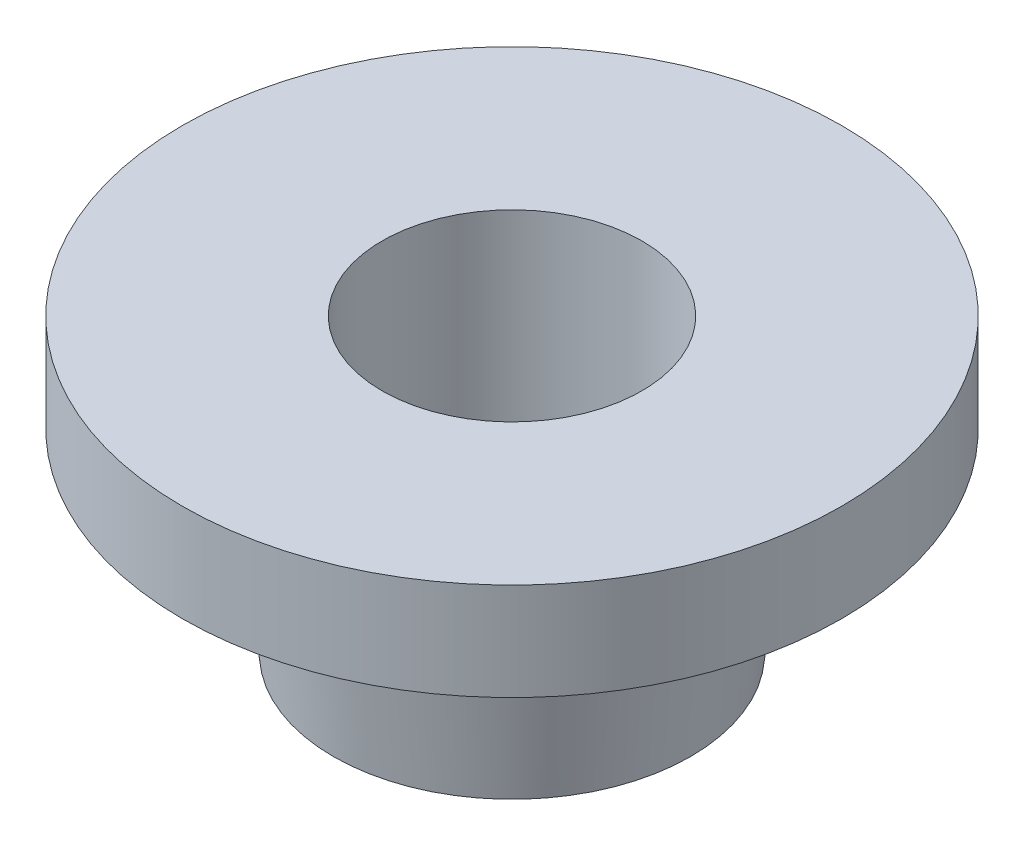
ISO-10303-21;
HEADER;
FILE_DESCRIPTION(('STEP AP214'),'2;1');
FILE_NAME('part.step','',(''),(''),'','','');
FILE_SCHEMA(('AUTOMOTIVE_DESIGN { 1 0 10303 214 1 1 1 1 }'));
ENDSEC;
DATA;
#1=APPLICATION_CONTEXT('core data for automotive mechanical design processes');
#2=APPLICATION_PROTOCOL_DEFINITION('international standard','automotive_design',2000,#1);
#3=PRODUCT_CONTEXT('',#1,'mechanical');
#4=PRODUCT('Part','Part','',(#3));
#5=PRODUCT_RELATED_PRODUCT_CATEGORY('part','',(#4));
#6=PRODUCT_DEFINITION_FORMATION('','',#4);
#7=PRODUCT_DEFINITION_CONTEXT('part definition',#1,'design');
#8=PRODUCT_DEFINITION('design','',#6,#7);
#9=PRODUCT_DEFINITION_SHAPE('','',#8);
#10=(LENGTH_UNIT() NAMED_UNIT(*) SI_UNIT(.MILLI.,.METRE.));
#11=(NAMED_UNIT(*) PLANE_ANGLE_UNIT() SI_UNIT($,.RADIAN.));
#12=(NAMED_UNIT(*) SI_UNIT($,.STERADIAN.) SOLID_ANGLE_UNIT());
#13=UNCERTAINTY_MEASURE_WITH_UNIT(LENGTH_MEASURE(1.E-05),#10,'distance_accuracy_value','');
#14=(GEOMETRIC_REPRESENTATION_CONTEXT(3) GLOBAL_UNCERTAINTY_ASSIGNED_CONTEXT((#13)) GLOBAL_UNIT_ASSIGNED_CONTEXT((#10,
#11,#12)) REPRESENTATION_CONTEXT('',''));
#15=CARTESIAN_POINT('',(0.,0.,0.));
#16=DIRECTION('',(0.,0.,1.));
#17=DIRECTION('',(1.,0.,0.));
#18=AXIS2_PLACEMENT_3D('',#15,#16,#17);
#19=CARTESIAN_POINT('',(0.,0.,0.));
#20=DIRECTION('',(0.,-1.,0.));
#21=DIRECTION('',(0.,0.,-1.));
#22=AXIS2_PLACEMENT_3D('',#19,#20,#21);
#23=CYLINDRICAL_SURFACE('',#22,4.);
#24=CARTESIAN_POINT('',(0.,9.00000000000001,0.));
#25=DIRECTION('',(0.,-1.,0.));
#26=DIRECTION('',(0.,0.,-1.));
#27=AXIS2_PLACEMENT_3D('',#24,#25,#26);
#28=CIRCLE('',#27,4.);
#29=CARTESIAN_POINT('',(0.,9.00000000000001,-4.));
#30=VERTEX_POINT('',#29);
#31=EDGE_CURVE('E10',#30,#30,#28,.T.);
#32=ORIENTED_EDGE('',*,*,#31,.F.);
#33=EDGE_LOOP('',(#32));
#34=FACE_BOUND('',#33,.T.);
#35=CARTESIAN_POINT('',(0.,0.,0.));
#36=DIRECTION('',(0.,-1.,0.));
#37=DIRECTION('',(0.,0.,-1.));
#38=AXIS2_PLACEMENT_3D('',#35,#36,#37);
#39=CIRCLE('',#38,4.);
#40=CARTESIAN_POINT('',(0.,0.,-4.));
#41=VERTEX_POINT('',#40);
#42=EDGE_CURVE('E53',#41,#41,#39,.T.);
#43=ORIENTED_EDGE('',*,*,#42,.T.);
#44=EDGE_LOOP('',(#43));
#45=FACE_BOUND('',#44,.T.);
#46=ADVANCED_FACE('F31',(#34,#45),#23,.F.);
#47=CARTESIAN_POINT('',(-4.,9.,0.));
#48=DIRECTION('',(0.,-1.,0.));
#49=DIRECTION('',(0.,0.,-1.));
#50=AXIS2_PLACEMENT_3D('',#47,#48,#49);
#51=PLANE('',#50);
#52=CARTESIAN_POINT('',(0.,9.,0.));
#53=DIRECTION('',(0.,-1.,0.));
#54=DIRECTION('',(0.,0.,-1.));
#55=AXIS2_PLACEMENT_3D('',#52,#53,#54);
#56=CIRCLE('',#55,10.15);
#57=CARTESIAN_POINT('',(0.,9.,-10.15));
#58=VERTEX_POINT('',#57);
#59=EDGE_CURVE('E37',#58,#58,#56,.T.);
#60=ORIENTED_EDGE('',*,*,#59,.F.);
#61=EDGE_LOOP('',(#60));
#62=FACE_BOUND('',#61,.T.);
#63=ORIENTED_EDGE('',*,*,#31,.T.);
#64=EDGE_LOOP('',(#63));
#65=FACE_BOUND('',#64,.T.);
#66=ADVANCED_FACE('F78',(#62,#65),#51,.F.);
#67=CARTESIAN_POINT('',(0.,0.,0.));
#68=DIRECTION('',(0.,-1.,0.));
#69=DIRECTION('',(0.,0.,-1.));
#70=AXIS2_PLACEMENT_3D('',#67,#68,#69);
#71=CYLINDRICAL_SURFACE('',#70,10.15);
#72=CARTESIAN_POINT('',(0.,6.,0.));
#73=DIRECTION('',(0.,-1.,0.));
#74=DIRECTION('',(0.,0.,-1.));
#75=AXIS2_PLACEMENT_3D('',#72,#73,#74);
#76=CIRCLE('',#75,10.15);
#77=CARTESIAN_POINT('',(0.,6.,-10.15));
#78=VERTEX_POINT('',#77);
#79=EDGE_CURVE('E41',#78,#78,#76,.T.);
#80=ORIENTED_EDGE('',*,*,#79,.F.);
#81=EDGE_LOOP('',(#80));
#82=FACE_BOUND('',#81,.T.);
#83=ORIENTED_EDGE('',*,*,#59,.T.);
#84=EDGE_LOOP('',(#83));
#85=FACE_BOUND('',#84,.T.);
#86=ADVANCED_FACE('F73',(#82,#85),#71,.T.);
#87=CARTESIAN_POINT('',(-10.15,6.,0.));
#88=DIRECTION('',(0.,1.,0.));
#89=DIRECTION('',(0.,0.,1.));
#90=AXIS2_PLACEMENT_3D('',#87,#88,#89);
#91=PLANE('',#90);
#92=CARTESIAN_POINT('',(0.,6.,0.));
#93=DIRECTION('',(0.,-1.,0.));
#94=DIRECTION('',(0.,0.,-1.));
#95=AXIS2_PLACEMENT_3D('',#92,#93,#94);
#96=CIRCLE('',#95,6.15);
#97=CARTESIAN_POINT('',(0.,6.,-6.15));
#98=VERTEX_POINT('',#97);
#99=EDGE_CURVE('E45',#98,#98,#96,.T.);
#100=ORIENTED_EDGE('',*,*,#99,.F.);
#101=EDGE_LOOP('',(#100));
#102=FACE_BOUND('',#101,.T.);
#103=ORIENTED_EDGE('',*,*,#79,.T.);
#104=EDGE_LOOP('',(#103));
#105=FACE_BOUND('',#104,.T.);
#106=ADVANCED_FACE('F67',(#102,#105),#91,.F.);
#107=CARTESIAN_POINT('',(0.,6.,0.));
#108=DIRECTION('',(0.,1.,0.));
#109=DIRECTION('',(0.,0.,1.));
#110=AXIS2_PLACEMENT_3D('',#107,#108,#109);
#111=CONICAL_SURFACE('',#110,6.15,0.107912488816677);
#112=CARTESIAN_POINT('',(0.,0.,0.));
#113=DIRECTION('',(0.,-1.,0.));
#114=DIRECTION('',(0.,0.,-1.));
#115=AXIS2_PLACEMENT_3D('',#112,#113,#114);
#116=CIRCLE('',#115,5.5);
#117=CARTESIAN_POINT('',(0.,0.,-5.5));
#118=VERTEX_POINT('',#117);
#119=EDGE_CURVE('E50',#118,#118,#116,.T.);
#120=ORIENTED_EDGE('',*,*,#119,.F.);
#121=EDGE_LOOP('',(#120));
#122=FACE_BOUND('',#121,.T.);
#123=ORIENTED_EDGE('',*,*,#99,.T.);
#124=EDGE_LOOP('',(#123));
#125=FACE_BOUND('',#124,.T.);
#126=ADVANCED_FACE('F61',(#122,#125),#111,.T.);
#127=CARTESIAN_POINT('',(-5.5,0.,0.));
#128=DIRECTION('',(0.,1.,0.));
#129=DIRECTION('',(0.,0.,1.));
#130=AXIS2_PLACEMENT_3D('',#127,#128,#129);
#131=PLANE('',#130);
#132=ORIENTED_EDGE('',*,*,#42,.F.);
#133=EDGE_LOOP('',(#132));
#134=FACE_BOUND('',#133,.T.);
#135=ORIENTED_EDGE('',*,*,#119,.T.);
#136=EDGE_LOOP('',(#135));
#137=FACE_BOUND('',#136,.T.);
#138=ADVANCED_FACE('F58',(#134,#137),#131,.F.);
#139=CLOSED_SHELL('',(#46,#66,#86,#106,#126,#138));
#140=MANIFOLD_SOLID_BREP('B2',#139);
#141=ADVANCED_BREP_SHAPE_REPRESENTATION('',(#18,#140),#14);
#142=SHAPE_DEFINITION_REPRESENTATION(#9,#141);
ENDSEC;
END-ISO-10303-21;
